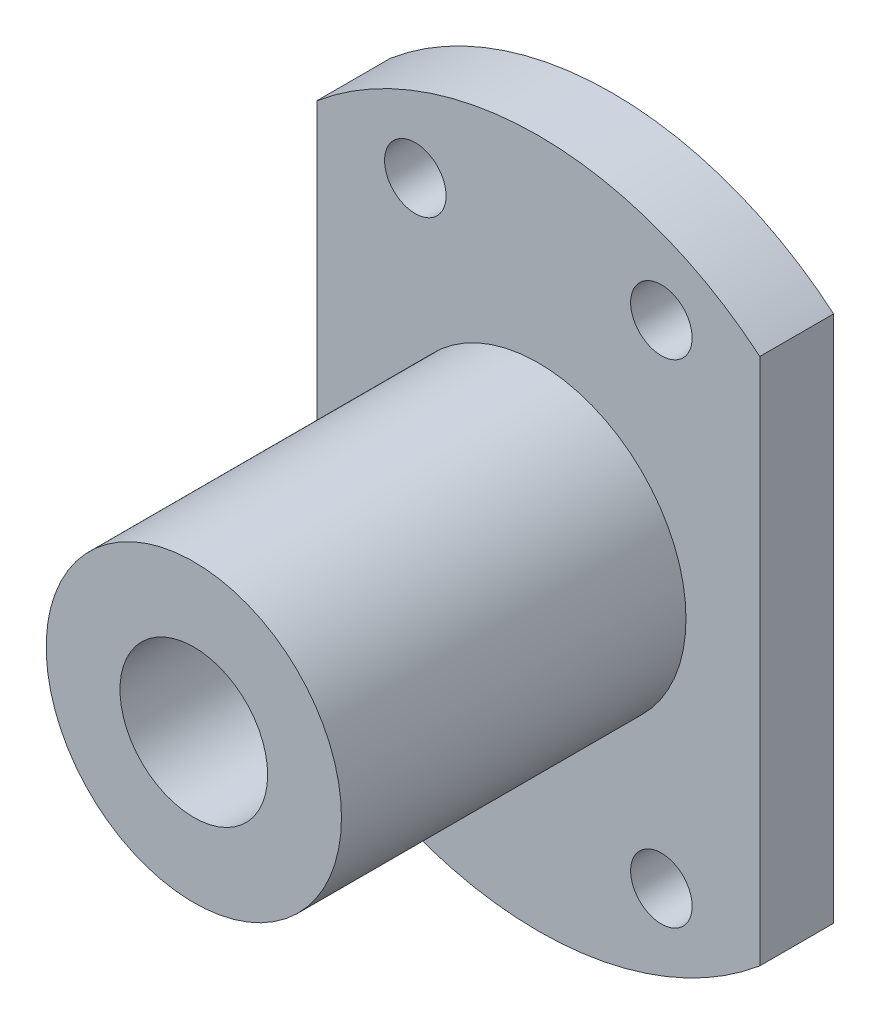
ISO-10303-21;
HEADER;
FILE_DESCRIPTION(('STEP AP214'),'2;1');
FILE_NAME('part.step','',(''),(''),'','','');
FILE_SCHEMA(('AUTOMOTIVE_DESIGN { 1 0 10303 214 1 1 1 1 }'));
ENDSEC;
DATA;
#1=APPLICATION_CONTEXT('core data for automotive mechanical design processes');
#2=APPLICATION_PROTOCOL_DEFINITION('international standard','automotive_design',2000,#1);
#3=PRODUCT_CONTEXT('',#1,'mechanical');
#4=PRODUCT('Part','Part','',(#3));
#5=PRODUCT_RELATED_PRODUCT_CATEGORY('part','',(#4));
#6=PRODUCT_DEFINITION_FORMATION('','',#4);
#7=PRODUCT_DEFINITION_CONTEXT('part definition',#1,'design');
#8=PRODUCT_DEFINITION('design','',#6,#7);
#9=PRODUCT_DEFINITION_SHAPE('','',#8);
#10=(LENGTH_UNIT() NAMED_UNIT(*) SI_UNIT(.MILLI.,.METRE.));
#11=(NAMED_UNIT(*) PLANE_ANGLE_UNIT() SI_UNIT($,.RADIAN.));
#12=(NAMED_UNIT(*) SI_UNIT($,.STERADIAN.) SOLID_ANGLE_UNIT());
#13=UNCERTAINTY_MEASURE_WITH_UNIT(LENGTH_MEASURE(1.E-05),#10,'distance_accuracy_value','');
#14=(GEOMETRIC_REPRESENTATION_CONTEXT(3) GLOBAL_UNCERTAINTY_ASSIGNED_CONTEXT((#13)) GLOBAL_UNIT_ASSIGNED_CONTEXT((#10,
#11,#12)) REPRESENTATION_CONTEXT('',''));
#15=CARTESIAN_POINT('',(0.,0.,0.));
#16=DIRECTION('',(0.,0.,1.));
#17=DIRECTION('',(1.,0.,0.));
#18=AXIS2_PLACEMENT_3D('',#15,#16,#17);
#19=CARTESIAN_POINT('',(0.,0.,3.));
#20=DIRECTION('',(0.,0.,1.));
#21=DIRECTION('',(1.,0.,0.));
#22=AXIS2_PLACEMENT_3D('',#19,#20,#21);
#23=PLANE('',#22);
#24=CARTESIAN_POINT('',(5.,-10.,3.));
#25=DIRECTION('',(0.,0.,1.));
#26=DIRECTION('',(1.,0.,0.));
#27=AXIS2_PLACEMENT_3D('',#24,#25,#26);
#28=CIRCLE('',#27,1.25);
#29=CARTESIAN_POINT('',(6.25,-10.,3.));
#30=VERTEX_POINT('',#29);
#31=EDGE_CURVE('E130',#30,#30,#28,.T.);
#32=ORIENTED_EDGE('',*,*,#31,.F.);
#33=EDGE_LOOP('',(#32));
#34=FACE_BOUND('',#33,.T.);
#35=CARTESIAN_POINT('',(5.,10.,3.));
#36=DIRECTION('',(0.,0.,1.));
#37=DIRECTION('',(1.,0.,0.));
#38=AXIS2_PLACEMENT_3D('',#35,#36,#37);
#39=CIRCLE('',#38,1.25);
#40=CARTESIAN_POINT('',(6.25,10.,3.));
#41=VERTEX_POINT('',#40);
#42=EDGE_CURVE('E118',#41,#41,#39,.T.);
#43=ORIENTED_EDGE('',*,*,#42,.F.);
#44=EDGE_LOOP('',(#43));
#45=FACE_BOUND('',#44,.T.);
#46=CARTESIAN_POINT('',(0.,0.,3.));
#47=DIRECTION('',(0.,0.,1.));
#48=DIRECTION('',(1.,0.,0.));
#49=AXIS2_PLACEMENT_3D('',#46,#47,#48);
#50=CIRCLE('',#49,14.);
#51=CARTESIAN_POINT('',(9.,10.7238052947636,3.));
#52=VERTEX_POINT('',#51);
#53=CARTESIAN_POINT('',(-9.,10.7238052947636,3.));
#54=VERTEX_POINT('',#53);
#55=EDGE_CURVE('E85',#52,#54,#50,.T.);
#56=ORIENTED_EDGE('',*,*,#55,.T.);
#57=DIRECTION('',(0.,-1.,0.));
#58=VECTOR('',#57,1.);
#59=CARTESIAN_POINT('',(-9.,10.7238052947636,3.));
#60=LINE('',#59,#58);
#61=CARTESIAN_POINT('',(-9.,-10.7238052947636,3.));
#62=VERTEX_POINT('',#61);
#63=EDGE_CURVE('E80',#54,#62,#60,.T.);
#64=ORIENTED_EDGE('',*,*,#63,.T.);
#65=CARTESIAN_POINT('',(0.,0.,3.));
#66=DIRECTION('',(0.,0.,1.));
#67=DIRECTION('',(1.,0.,0.));
#68=AXIS2_PLACEMENT_3D('',#65,#66,#67);
#69=CIRCLE('',#68,14.);
#70=CARTESIAN_POINT('',(9.,-10.7238052947636,3.));
#71=VERTEX_POINT('',#70);
#72=EDGE_CURVE('E83',#62,#71,#69,.T.);
#73=ORIENTED_EDGE('',*,*,#72,.T.);
#74=DIRECTION('',(0.,1.,0.));
#75=VECTOR('',#74,1.);
#76=CARTESIAN_POINT('',(9.,10.7238052947636,3.));
#77=LINE('',#76,#75);
#78=EDGE_CURVE('E50',#71,#52,#77,.T.);
#79=ORIENTED_EDGE('',*,*,#78,.T.);
#80=EDGE_LOOP('',(#56,#64,#73,#79));
#81=FACE_BOUND('',#80,.T.);
#82=CARTESIAN_POINT('',(-5.,10.,3.));
#83=DIRECTION('',(0.,0.,1.));
#84=DIRECTION('',(1.,0.,0.));
#85=AXIS2_PLACEMENT_3D('',#82,#83,#84);
#86=CIRCLE('',#85,1.25);
#87=CARTESIAN_POINT('',(-3.75,10.,3.));
#88=VERTEX_POINT('',#87);
#89=EDGE_CURVE('E114',#88,#88,#86,.T.);
#90=ORIENTED_EDGE('',*,*,#89,.F.);
#91=EDGE_LOOP('',(#90));
#92=FACE_BOUND('',#91,.T.);
#93=CARTESIAN_POINT('',(-5.,-10.,3.));
#94=DIRECTION('',(0.,0.,1.));
#95=DIRECTION('',(1.,0.,0.));
#96=AXIS2_PLACEMENT_3D('',#93,#94,#95);
#97=CIRCLE('',#96,1.25);
#98=CARTESIAN_POINT('',(-3.75,-10.,3.));
#99=VERTEX_POINT('',#98);
#100=EDGE_CURVE('E124',#99,#99,#97,.T.);
#101=ORIENTED_EDGE('',*,*,#100,.F.);
#102=EDGE_LOOP('',(#101));
#103=FACE_BOUND('',#102,.T.);
#104=CARTESIAN_POINT('',(0.,0.,3.));
#105=DIRECTION('',(0.,0.,1.));
#106=DIRECTION('',(1.,0.,0.));
#107=AXIS2_PLACEMENT_3D('',#104,#105,#106);
#108=CIRCLE('',#107,6.);
#109=CARTESIAN_POINT('',(6.,0.,3.));
#110=VERTEX_POINT('',#109);
#111=EDGE_CURVE('E139',#110,#110,#108,.T.);
#112=ORIENTED_EDGE('',*,*,#111,.F.);
#113=EDGE_LOOP('',(#112));
#114=FACE_BOUND('',#113,.T.);
#115=ADVANCED_FACE('F33',(#34,#45,#81,#92,#103,#114),#23,.T.);
#116=CARTESIAN_POINT('',(0.,0.,0.));
#117=DIRECTION('',(0.,0.,1.));
#118=DIRECTION('',(1.,0.,0.));
#119=AXIS2_PLACEMENT_3D('',#116,#117,#118);
#120=PLANE('',#119);
#121=CARTESIAN_POINT('',(0.,0.,0.));
#122=DIRECTION('',(0.,0.,1.));
#123=DIRECTION('',(1.,0.,0.));
#124=AXIS2_PLACEMENT_3D('',#121,#122,#123);
#125=CIRCLE('',#124,14.);
#126=CARTESIAN_POINT('',(9.,10.7238052947636,0.));
#127=VERTEX_POINT('',#126);
#128=CARTESIAN_POINT('',(-9.,10.7238052947636,0.));
#129=VERTEX_POINT('',#128);
#130=EDGE_CURVE('E97',#127,#129,#125,.T.);
#131=ORIENTED_EDGE('',*,*,#130,.F.);
#132=DIRECTION('',(0.,1.,0.));
#133=VECTOR('',#132,1.);
#134=CARTESIAN_POINT('',(9.,10.7238052947636,0.));
#135=LINE('',#134,#133);
#136=CARTESIAN_POINT('',(9.,-10.7238052947636,0.));
#137=VERTEX_POINT('',#136);
#138=EDGE_CURVE('E73',#137,#127,#135,.T.);
#139=ORIENTED_EDGE('',*,*,#138,.F.);
#140=CARTESIAN_POINT('',(0.,0.,0.));
#141=DIRECTION('',(0.,0.,1.));
#142=DIRECTION('',(1.,0.,0.));
#143=AXIS2_PLACEMENT_3D('',#140,#141,#142);
#144=CIRCLE('',#143,14.);
#145=CARTESIAN_POINT('',(-9.,-10.7238052947636,0.));
#146=VERTEX_POINT('',#145);
#147=EDGE_CURVE('E67',#146,#137,#144,.T.);
#148=ORIENTED_EDGE('',*,*,#147,.F.);
#149=DIRECTION('',(0.,-1.,0.));
#150=VECTOR('',#149,1.);
#151=CARTESIAN_POINT('',(-9.,10.7238052947636,0.));
#152=LINE('',#151,#150);
#153=EDGE_CURVE('E89',#129,#146,#152,.T.);
#154=ORIENTED_EDGE('',*,*,#153,.F.);
#155=EDGE_LOOP('',(#131,#139,#148,#154));
#156=FACE_BOUND('',#155,.T.);
#157=CARTESIAN_POINT('',(0.,0.,0.));
#158=DIRECTION('',(0.,0.,1.));
#159=DIRECTION('',(1.,0.,0.));
#160=AXIS2_PLACEMENT_3D('',#157,#158,#159);
#161=CIRCLE('',#160,3.);
#162=CARTESIAN_POINT('',(3.,0.,0.));
#163=VERTEX_POINT('',#162);
#164=EDGE_CURVE('E100',#163,#163,#161,.T.);
#165=ORIENTED_EDGE('',*,*,#164,.T.);
#166=EDGE_LOOP('',(#165));
#167=FACE_BOUND('',#166,.T.);
#168=CARTESIAN_POINT('',(-5.,10.,0.));
#169=DIRECTION('',(0.,0.,1.));
#170=DIRECTION('',(1.,0.,0.));
#171=AXIS2_PLACEMENT_3D('',#168,#169,#170);
#172=CIRCLE('',#171,1.25);
#173=CARTESIAN_POINT('',(-3.75,10.,0.));
#174=VERTEX_POINT('',#173);
#175=EDGE_CURVE('E115',#174,#174,#172,.T.);
#176=ORIENTED_EDGE('',*,*,#175,.T.);
#177=EDGE_LOOP('',(#176));
#178=FACE_BOUND('',#177,.T.);
#179=CARTESIAN_POINT('',(5.,10.,0.));
#180=DIRECTION('',(0.,0.,1.));
#181=DIRECTION('',(1.,0.,0.));
#182=AXIS2_PLACEMENT_3D('',#179,#180,#181);
#183=CIRCLE('',#182,1.25);
#184=CARTESIAN_POINT('',(6.25,10.,0.));
#185=VERTEX_POINT('',#184);
#186=EDGE_CURVE('E121',#185,#185,#183,.T.);
#187=ORIENTED_EDGE('',*,*,#186,.T.);
#188=EDGE_LOOP('',(#187));
#189=FACE_BOUND('',#188,.T.);
#190=CARTESIAN_POINT('',(-5.,-10.,0.));
#191=DIRECTION('',(0.,0.,1.));
#192=DIRECTION('',(1.,0.,0.));
#193=AXIS2_PLACEMENT_3D('',#190,#191,#192);
#194=CIRCLE('',#193,1.25);
#195=CARTESIAN_POINT('',(-3.75,-10.,0.));
#196=VERTEX_POINT('',#195);
#197=EDGE_CURVE('E127',#196,#196,#194,.T.);
#198=ORIENTED_EDGE('',*,*,#197,.T.);
#199=EDGE_LOOP('',(#198));
#200=FACE_BOUND('',#199,.T.);
#201=CARTESIAN_POINT('',(5.,-10.,0.));
#202=DIRECTION('',(0.,0.,1.));
#203=DIRECTION('',(1.,0.,0.));
#204=AXIS2_PLACEMENT_3D('',#201,#202,#203);
#205=CIRCLE('',#204,1.25);
#206=CARTESIAN_POINT('',(6.25,-10.,0.));
#207=VERTEX_POINT('',#206);
#208=EDGE_CURVE('E133',#207,#207,#205,.T.);
#209=ORIENTED_EDGE('',*,*,#208,.T.);
#210=EDGE_LOOP('',(#209));
#211=FACE_BOUND('',#210,.T.);
#212=ADVANCED_FACE('F108',(#156,#167,#178,#189,#200,#211),#120,.F.);
#213=CARTESIAN_POINT('',(0.,0.,3.));
#214=DIRECTION('',(0.,0.,-1.));
#215=DIRECTION('',(-1.,0.,0.));
#216=AXIS2_PLACEMENT_3D('',#213,#214,#215);
#217=CYLINDRICAL_SURFACE('',#216,14.);
#218=ORIENTED_EDGE('',*,*,#130,.T.);
#219=DIRECTION('',(0.,0.,-1.));
#220=VECTOR('',#219,1.);
#221=CARTESIAN_POINT('',(-9.,10.7238052947636,3.));
#222=LINE('',#221,#220);
#223=EDGE_CURVE('E11',#54,#129,#222,.T.);
#224=ORIENTED_EDGE('',*,*,#223,.F.);
#225=ORIENTED_EDGE('',*,*,#55,.F.);
#226=DIRECTION('',(0.,0.,-1.));
#227=VECTOR('',#226,1.);
#228=CARTESIAN_POINT('',(9.,10.7238052947636,3.));
#229=LINE('',#228,#227);
#230=EDGE_CURVE('E93',#52,#127,#229,.T.);
#231=ORIENTED_EDGE('',*,*,#230,.T.);
#232=EDGE_LOOP('',(#218,#224,#225,#231));
#233=FACE_BOUND('',#232,.T.);
#234=ADVANCED_FACE('F35',(#233),#217,.T.);
#235=CARTESIAN_POINT('',(-9.,10.7238052947636,3.));
#236=DIRECTION('',(1.,0.,0.));
#237=DIRECTION('',(0.,0.,-1.));
#238=AXIS2_PLACEMENT_3D('',#235,#236,#237);
#239=PLANE('',#238);
#240=ORIENTED_EDGE('',*,*,#153,.T.);
#241=DIRECTION('',(0.,0.,-1.));
#242=VECTOR('',#241,1.);
#243=CARTESIAN_POINT('',(-9.,-10.7238052947636,3.));
#244=LINE('',#243,#242);
#245=EDGE_CURVE('E42',#62,#146,#244,.T.);
#246=ORIENTED_EDGE('',*,*,#245,.F.);
#247=ORIENTED_EDGE('',*,*,#63,.F.);
#248=ORIENTED_EDGE('',*,*,#223,.T.);
#249=EDGE_LOOP('',(#240,#246,#247,#248));
#250=FACE_BOUND('',#249,.T.);
#251=ADVANCED_FACE('F88',(#250),#239,.F.);
#252=CARTESIAN_POINT('',(0.,0.,3.));
#253=DIRECTION('',(0.,0.,-1.));
#254=DIRECTION('',(-1.,0.,0.));
#255=AXIS2_PLACEMENT_3D('',#252,#253,#254);
#256=CYLINDRICAL_SURFACE('',#255,14.);
#257=ORIENTED_EDGE('',*,*,#147,.T.);
#258=DIRECTION('',(0.,0.,-1.));
#259=VECTOR('',#258,1.);
#260=CARTESIAN_POINT('',(9.,-10.7238052947636,3.));
#261=LINE('',#260,#259);
#262=EDGE_CURVE('E90',#71,#137,#261,.T.);
#263=ORIENTED_EDGE('',*,*,#262,.F.);
#264=ORIENTED_EDGE('',*,*,#72,.F.);
#265=ORIENTED_EDGE('',*,*,#245,.T.);
#266=EDGE_LOOP('',(#257,#263,#264,#265));
#267=FACE_BOUND('',#266,.T.);
#268=ADVANCED_FACE('F91',(#267),#256,.T.);
#269=CARTESIAN_POINT('',(9.,10.7238052947636,3.));
#270=DIRECTION('',(-1.,0.,0.));
#271=DIRECTION('',(0.,0.,1.));
#272=AXIS2_PLACEMENT_3D('',#269,#270,#271);
#273=PLANE('',#272);
#274=ORIENTED_EDGE('',*,*,#138,.T.);
#275=ORIENTED_EDGE('',*,*,#230,.F.);
#276=ORIENTED_EDGE('',*,*,#78,.F.);
#277=ORIENTED_EDGE('',*,*,#262,.T.);
#278=EDGE_LOOP('',(#274,#275,#276,#277));
#279=FACE_BOUND('',#278,.T.);
#280=ADVANCED_FACE('F105',(#279),#273,.F.);
#281=CARTESIAN_POINT('',(0.,0.,3.));
#282=DIRECTION('',(0.,0.,-1.));
#283=DIRECTION('',(-1.,0.,0.));
#284=AXIS2_PLACEMENT_3D('',#281,#282,#283);
#285=CYLINDRICAL_SURFACE('',#284,3.);
#286=ORIENTED_EDGE('',*,*,#164,.F.);
#287=EDGE_LOOP('',(#286));
#288=FACE_BOUND('',#287,.T.);
#289=CARTESIAN_POINT('',(0.,0.,17.));
#290=DIRECTION('',(0.,0.,1.));
#291=DIRECTION('',(1.,0.,0.));
#292=AXIS2_PLACEMENT_3D('',#289,#290,#291);
#293=CIRCLE('',#292,3.);
#294=CARTESIAN_POINT('',(3.,0.,17.));
#295=VERTEX_POINT('',#294);
#296=EDGE_CURVE('E142',#295,#295,#293,.T.);
#297=ORIENTED_EDGE('',*,*,#296,.T.);
#298=EDGE_LOOP('',(#297));
#299=FACE_BOUND('',#298,.T.);
#300=ADVANCED_FACE('F148',(#288,#299),#285,.F.);
#301=CARTESIAN_POINT('',(-5.,10.,3.));
#302=DIRECTION('',(0.,0.,-1.));
#303=DIRECTION('',(-1.,0.,0.));
#304=AXIS2_PLACEMENT_3D('',#301,#302,#303);
#305=CYLINDRICAL_SURFACE('',#304,1.25);
#306=ORIENTED_EDGE('',*,*,#89,.T.);
#307=EDGE_LOOP('',(#306));
#308=FACE_BOUND('',#307,.T.);
#309=ORIENTED_EDGE('',*,*,#175,.F.);
#310=EDGE_LOOP('',(#309));
#311=FACE_BOUND('',#310,.T.);
#312=ADVANCED_FACE('F217',(#308,#311),#305,.F.);
#313=CARTESIAN_POINT('',(5.,10.,3.));
#314=DIRECTION('',(0.,0.,-1.));
#315=DIRECTION('',(-1.,0.,0.));
#316=AXIS2_PLACEMENT_3D('',#313,#314,#315);
#317=CYLINDRICAL_SURFACE('',#316,1.25);
#318=ORIENTED_EDGE('',*,*,#42,.T.);
#319=EDGE_LOOP('',(#318));
#320=FACE_BOUND('',#319,.T.);
#321=ORIENTED_EDGE('',*,*,#186,.F.);
#322=EDGE_LOOP('',(#321));
#323=FACE_BOUND('',#322,.T.);
#324=ADVANCED_FACE('F228',(#320,#323),#317,.F.);
#325=CARTESIAN_POINT('',(-5.,-10.,3.));
#326=DIRECTION('',(0.,0.,-1.));
#327=DIRECTION('',(-1.,0.,0.));
#328=AXIS2_PLACEMENT_3D('',#325,#326,#327);
#329=CYLINDRICAL_SURFACE('',#328,1.25);
#330=ORIENTED_EDGE('',*,*,#100,.T.);
#331=EDGE_LOOP('',(#330));
#332=FACE_BOUND('',#331,.T.);
#333=ORIENTED_EDGE('',*,*,#197,.F.);
#334=EDGE_LOOP('',(#333));
#335=FACE_BOUND('',#334,.T.);
#336=ADVANCED_FACE('F162',(#332,#335),#329,.F.);
#337=CARTESIAN_POINT('',(5.,-10.,3.));
#338=DIRECTION('',(0.,0.,-1.));
#339=DIRECTION('',(-1.,0.,0.));
#340=AXIS2_PLACEMENT_3D('',#337,#338,#339);
#341=CYLINDRICAL_SURFACE('',#340,1.25);
#342=ORIENTED_EDGE('',*,*,#31,.T.);
#343=EDGE_LOOP('',(#342));
#344=FACE_BOUND('',#343,.T.);
#345=ORIENTED_EDGE('',*,*,#208,.F.);
#346=EDGE_LOOP('',(#345));
#347=FACE_BOUND('',#346,.T.);
#348=ADVANCED_FACE('F153',(#344,#347),#341,.F.);
#349=CARTESIAN_POINT('',(0.,0.,17.));
#350=DIRECTION('',(0.,0.,1.));
#351=DIRECTION('',(1.,0.,0.));
#352=AXIS2_PLACEMENT_3D('',#349,#350,#351);
#353=PLANE('',#352);
#354=CARTESIAN_POINT('',(0.,0.,17.));
#355=DIRECTION('',(0.,0.,1.));
#356=DIRECTION('',(1.,0.,0.));
#357=AXIS2_PLACEMENT_3D('',#354,#355,#356);
#358=CIRCLE('',#357,6.);
#359=CARTESIAN_POINT('',(6.,0.,17.));
#360=VERTEX_POINT('',#359);
#361=EDGE_CURVE('E136',#360,#360,#358,.T.);
#362=ORIENTED_EDGE('',*,*,#361,.T.);
#363=EDGE_LOOP('',(#362));
#364=FACE_BOUND('',#363,.T.);
#365=ORIENTED_EDGE('',*,*,#296,.F.);
#366=EDGE_LOOP('',(#365));
#367=FACE_BOUND('',#366,.T.);
#368=ADVANCED_FACE('F150',(#364,#367),#353,.T.);
#369=CARTESIAN_POINT('',(0.,0.,17.));
#370=DIRECTION('',(0.,0.,-1.));
#371=DIRECTION('',(-1.,0.,0.));
#372=AXIS2_PLACEMENT_3D('',#369,#370,#371);
#373=CYLINDRICAL_SURFACE('',#372,6.);
#374=ORIENTED_EDGE('',*,*,#361,.F.);
#375=EDGE_LOOP('',(#374));
#376=FACE_BOUND('',#375,.T.);
#377=ORIENTED_EDGE('',*,*,#111,.T.);
#378=EDGE_LOOP('',(#377));
#379=FACE_BOUND('',#378,.T.);
#380=ADVANCED_FACE('F152',(#376,#379),#373,.T.);
#381=CLOSED_SHELL('',(#115,#212,#234,#251,#268,#280,#300,#312,#324,#336,#348,#368,#380));
#382=MANIFOLD_SOLID_BREP('B2',#381);
#383=ADVANCED_BREP_SHAPE_REPRESENTATION('',(#18,#382),#14);
#384=SHAPE_DEFINITION_REPRESENTATION(#9,#383);
ENDSEC;
END-ISO-10303-21;
